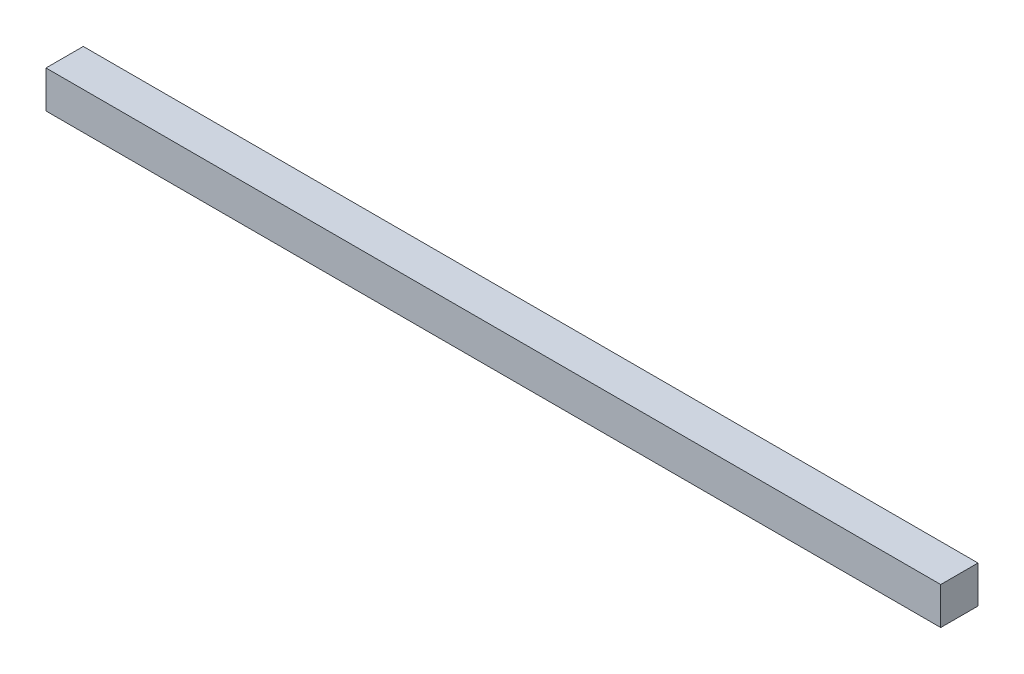
ISO-10303-21;
HEADER;
FILE_DESCRIPTION(('STEP AP214'),'2;1');
FILE_NAME('part.step','',(''),(''),'','','');
FILE_SCHEMA(('AUTOMOTIVE_DESIGN { 1 0 10303 214 1 1 1 1 }'));
ENDSEC;
DATA;
#1=APPLICATION_CONTEXT('core data for automotive mechanical design processes');
#2=APPLICATION_PROTOCOL_DEFINITION('international standard','automotive_design',2000,#1);
#3=PRODUCT_CONTEXT('',#1,'mechanical');
#4=PRODUCT('Part','Part','',(#3));
#5=PRODUCT_RELATED_PRODUCT_CATEGORY('part','',(#4));
#6=PRODUCT_DEFINITION_FORMATION('','',#4);
#7=PRODUCT_DEFINITION_CONTEXT('part definition',#1,'design');
#8=PRODUCT_DEFINITION('design','',#6,#7);
#9=PRODUCT_DEFINITION_SHAPE('','',#8);
#10=(LENGTH_UNIT() NAMED_UNIT(*) SI_UNIT(.MILLI.,.METRE.));
#11=(NAMED_UNIT(*) PLANE_ANGLE_UNIT() SI_UNIT($,.RADIAN.));
#12=(NAMED_UNIT(*) SI_UNIT($,.STERADIAN.) SOLID_ANGLE_UNIT());
#13=UNCERTAINTY_MEASURE_WITH_UNIT(LENGTH_MEASURE(1.E-05),#10,'distance_accuracy_value','');
#14=(GEOMETRIC_REPRESENTATION_CONTEXT(3) GLOBAL_UNCERTAINTY_ASSIGNED_CONTEXT((#13)) GLOBAL_UNIT_ASSIGNED_CONTEXT((#10,
#11,#12)) REPRESENTATION_CONTEXT('',''));
#15=CARTESIAN_POINT('',(0.,0.,0.));
#16=DIRECTION('',(0.,0.,1.));
#17=DIRECTION('',(1.,0.,0.));
#18=AXIS2_PLACEMENT_3D('',#15,#16,#17);
#19=CARTESIAN_POINT('',(-46.9489927306625,25.4,-20.9847770538567));
#20=DIRECTION('',(1.,0.,0.));
#21=DIRECTION('',(0.,0.,-1.));
#22=AXIS2_PLACEMENT_3D('',#19,#20,#21);
#23=PLANE('',#22);
#24=DIRECTION('',(0.,0.,1.));
#25=VECTOR('',#24,1.);
#26=CARTESIAN_POINT('',(-46.9489927306625,0.,-20.9847770538567));
#27=LINE('',#26,#25);
#28=CARTESIAN_POINT('',(-46.9489927306625,0.,-20.9847770538567));
#29=VERTEX_POINT('',#28);
#30=CARTESIAN_POINT('',(-46.9489927306625,0.,4.41522294614328));
#31=VERTEX_POINT('',#30);
#32=EDGE_CURVE('E94',#29,#31,#27,.T.);
#33=ORIENTED_EDGE('',*,*,#32,.T.);
#34=DIRECTION('',(0.,-1.,0.));
#35=VECTOR('',#34,1.);
#36=CARTESIAN_POINT('',(-46.9489927306625,25.4,4.41522294614328));
#37=LINE('',#36,#35);
#38=CARTESIAN_POINT('',(-46.9489927306625,25.4,4.41522294614328));
#39=VERTEX_POINT('',#38);
#40=EDGE_CURVE('E11',#39,#31,#37,.T.);
#41=ORIENTED_EDGE('',*,*,#40,.F.);
#42=DIRECTION('',(0.,0.,1.));
#43=VECTOR('',#42,1.);
#44=CARTESIAN_POINT('',(-46.9489927306625,25.4,-20.9847770538567));
#45=LINE('',#44,#43);
#46=CARTESIAN_POINT('',(-46.9489927306625,25.4,-20.9847770538567));
#47=VERTEX_POINT('',#46);
#48=EDGE_CURVE('E82',#47,#39,#45,.T.);
#49=ORIENTED_EDGE('',*,*,#48,.F.);
#50=DIRECTION('',(0.,-1.,0.));
#51=VECTOR('',#50,1.);
#52=CARTESIAN_POINT('',(-46.9489927306625,25.4,-20.9847770538567));
#53=LINE('',#52,#51);
#54=EDGE_CURVE('E90',#47,#29,#53,.T.);
#55=ORIENTED_EDGE('',*,*,#54,.T.);
#56=EDGE_LOOP('',(#33,#41,#49,#55));
#57=FACE_BOUND('',#56,.T.);
#58=ADVANCED_FACE('F31',(#57),#23,.F.);
#59=CARTESIAN_POINT('',(-46.9489927306625,25.4,4.41522294614328));
#60=DIRECTION('',(0.,0.,-1.));
#61=DIRECTION('',(-1.,0.,0.));
#62=AXIS2_PLACEMENT_3D('',#59,#60,#61);
#63=PLANE('',#62);
#64=DIRECTION('',(1.,0.,0.));
#65=VECTOR('',#64,1.);
#66=CARTESIAN_POINT('',(-46.9489927306625,0.,4.41522294614328));
#67=LINE('',#66,#65);
#68=CARTESIAN_POINT('',(562.651007269338,0.,4.41522294614328));
#69=VERTEX_POINT('',#68);
#70=EDGE_CURVE('E86',#31,#69,#67,.T.);
#71=ORIENTED_EDGE('',*,*,#70,.T.);
#72=DIRECTION('',(0.,-1.,0.));
#73=VECTOR('',#72,1.);
#74=CARTESIAN_POINT('',(562.651007269338,25.4,4.41522294614328));
#75=LINE('',#74,#73);
#76=CARTESIAN_POINT('',(562.651007269338,25.4,4.41522294614328));
#77=VERTEX_POINT('',#76);
#78=EDGE_CURVE('E39',#77,#69,#75,.T.);
#79=ORIENTED_EDGE('',*,*,#78,.F.);
#80=DIRECTION('',(1.,0.,0.));
#81=VECTOR('',#80,1.);
#82=CARTESIAN_POINT('',(-46.9489927306625,25.4,4.41522294614328));
#83=LINE('',#82,#81);
#84=EDGE_CURVE('E77',#39,#77,#83,.T.);
#85=ORIENTED_EDGE('',*,*,#84,.F.);
#86=ORIENTED_EDGE('',*,*,#40,.T.);
#87=EDGE_LOOP('',(#71,#79,#85,#86));
#88=FACE_BOUND('',#87,.T.);
#89=ADVANCED_FACE('F85',(#88),#63,.F.);
#90=CARTESIAN_POINT('',(562.651007269338,25.4,-20.9847770538567));
#91=DIRECTION('',(-1.,0.,0.));
#92=DIRECTION('',(0.,0.,1.));
#93=AXIS2_PLACEMENT_3D('',#90,#91,#92);
#94=PLANE('',#93);
#95=DIRECTION('',(0.,0.,-1.));
#96=VECTOR('',#95,1.);
#97=CARTESIAN_POINT('',(562.651007269338,0.,-20.9847770538567));
#98=LINE('',#97,#96);
#99=CARTESIAN_POINT('',(562.651007269338,0.,-20.9847770538567));
#100=VERTEX_POINT('',#99);
#101=EDGE_CURVE('E64',#69,#100,#98,.T.);
#102=ORIENTED_EDGE('',*,*,#101,.T.);
#103=DIRECTION('',(0.,-1.,0.));
#104=VECTOR('',#103,1.);
#105=CARTESIAN_POINT('',(562.651007269338,25.4,-20.9847770538567));
#106=LINE('',#105,#104);
#107=CARTESIAN_POINT('',(562.651007269338,25.4,-20.9847770538567));
#108=VERTEX_POINT('',#107);
#109=EDGE_CURVE('E87',#108,#100,#106,.T.);
#110=ORIENTED_EDGE('',*,*,#109,.F.);
#111=DIRECTION('',(0.,0.,-1.));
#112=VECTOR('',#111,1.);
#113=CARTESIAN_POINT('',(562.651007269338,25.4,-20.9847770538567));
#114=LINE('',#113,#112);
#115=EDGE_CURVE('E80',#77,#108,#114,.T.);
#116=ORIENTED_EDGE('',*,*,#115,.F.);
#117=ORIENTED_EDGE('',*,*,#78,.T.);
#118=EDGE_LOOP('',(#102,#110,#116,#117));
#119=FACE_BOUND('',#118,.T.);
#120=ADVANCED_FACE('F88',(#119),#94,.F.);
#121=CARTESIAN_POINT('',(-46.9489927306625,25.4,-20.9847770538567));
#122=DIRECTION('',(0.,0.,1.));
#123=DIRECTION('',(1.,0.,0.));
#124=AXIS2_PLACEMENT_3D('',#121,#122,#123);
#125=PLANE('',#124);
#126=DIRECTION('',(-1.,0.,0.));
#127=VECTOR('',#126,1.);
#128=CARTESIAN_POINT('',(-46.9489927306625,0.,-20.9847770538567));
#129=LINE('',#128,#127);
#130=EDGE_CURVE('E70',#100,#29,#129,.T.);
#131=ORIENTED_EDGE('',*,*,#130,.T.);
#132=ORIENTED_EDGE('',*,*,#54,.F.);
#133=DIRECTION('',(-1.,0.,0.));
#134=VECTOR('',#133,1.);
#135=CARTESIAN_POINT('',(-46.9489927306625,25.4,-20.9847770538567));
#136=LINE('',#135,#134);
#137=EDGE_CURVE('E47',#108,#47,#136,.T.);
#138=ORIENTED_EDGE('',*,*,#137,.F.);
#139=ORIENTED_EDGE('',*,*,#109,.T.);
#140=EDGE_LOOP('',(#131,#132,#138,#139));
#141=FACE_BOUND('',#140,.T.);
#142=ADVANCED_FACE('F101',(#141),#125,.F.);
#143=CARTESIAN_POINT('',(-46.9489927306625,25.4,4.41522294614328));
#144=DIRECTION('',(0.,1.,0.));
#145=DIRECTION('',(0.,0.,1.));
#146=AXIS2_PLACEMENT_3D('',#143,#144,#145);
#147=PLANE('',#146);
#148=ORIENTED_EDGE('',*,*,#48,.T.);
#149=ORIENTED_EDGE('',*,*,#84,.T.);
#150=ORIENTED_EDGE('',*,*,#115,.T.);
#151=ORIENTED_EDGE('',*,*,#137,.T.);
#152=EDGE_LOOP('',(#148,#149,#150,#151));
#153=FACE_BOUND('',#152,.T.);
#154=ADVANCED_FACE('F78',(#153),#147,.T.);
#155=CARTESIAN_POINT('',(-46.9489927306625,0.,4.41522294614328));
#156=DIRECTION('',(0.,1.,0.));
#157=DIRECTION('',(0.,0.,1.));
#158=AXIS2_PLACEMENT_3D('',#155,#156,#157);
#159=PLANE('',#158);
#160=ORIENTED_EDGE('',*,*,#32,.F.);
#161=ORIENTED_EDGE('',*,*,#130,.F.);
#162=ORIENTED_EDGE('',*,*,#101,.F.);
#163=ORIENTED_EDGE('',*,*,#70,.F.);
#164=EDGE_LOOP('',(#160,#161,#162,#163));
#165=FACE_BOUND('',#164,.T.);
#166=ADVANCED_FACE('F104',(#165),#159,.F.);
#167=CLOSED_SHELL('',(#58,#89,#120,#142,#154,#166));
#168=MANIFOLD_SOLID_BREP('B2',#167);
#169=ADVANCED_BREP_SHAPE_REPRESENTATION('',(#18,#168),#14);
#170=SHAPE_DEFINITION_REPRESENTATION(#9,#169);
ENDSEC;
END-ISO-10303-21;
